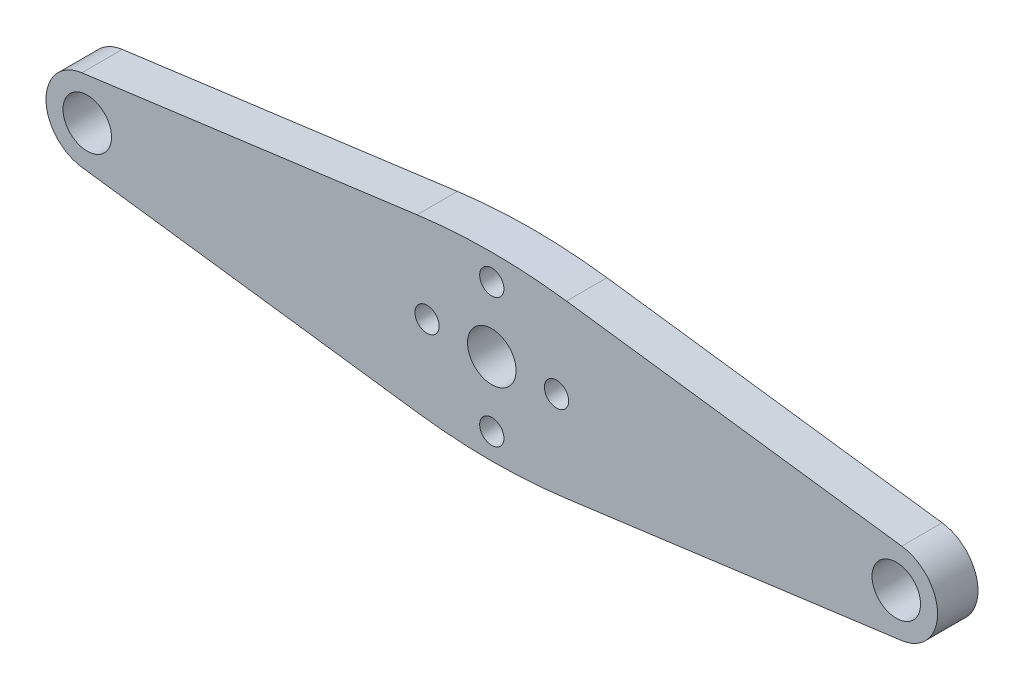
ISO-10303-21;
HEADER;
FILE_DESCRIPTION(('STEP AP214'),'2;1');
FILE_NAME('part.step','',(''),(''),'','','');
FILE_SCHEMA(('AUTOMOTIVE_DESIGN { 1 0 10303 214 1 1 1 1 }'));
ENDSEC;
DATA;
#1=APPLICATION_CONTEXT('core data for automotive mechanical design processes');
#2=APPLICATION_PROTOCOL_DEFINITION('international standard','automotive_design',2000,#1);
#3=PRODUCT_CONTEXT('',#1,'mechanical');
#4=PRODUCT('Part','Part','',(#3));
#5=PRODUCT_RELATED_PRODUCT_CATEGORY('part','',(#4));
#6=PRODUCT_DEFINITION_FORMATION('','',#4);
#7=PRODUCT_DEFINITION_CONTEXT('part definition',#1,'design');
#8=PRODUCT_DEFINITION('design','',#6,#7);
#9=PRODUCT_DEFINITION_SHAPE('','',#8);
#10=(LENGTH_UNIT() NAMED_UNIT(*) SI_UNIT(.MILLI.,.METRE.));
#11=(NAMED_UNIT(*) PLANE_ANGLE_UNIT() SI_UNIT($,.RADIAN.));
#12=(NAMED_UNIT(*) SI_UNIT($,.STERADIAN.) SOLID_ANGLE_UNIT());
#13=UNCERTAINTY_MEASURE_WITH_UNIT(LENGTH_MEASURE(1.E-05),#10,'distance_accuracy_value','');
#14=(GEOMETRIC_REPRESENTATION_CONTEXT(3) GLOBAL_UNCERTAINTY_ASSIGNED_CONTEXT((#13)) GLOBAL_UNIT_ASSIGNED_CONTEXT((#10,
#11,#12)) REPRESENTATION_CONTEXT('',''));
#15=CARTESIAN_POINT('',(0.,0.,0.));
#16=DIRECTION('',(0.,0.,1.));
#17=DIRECTION('',(1.,0.,0.));
#18=AXIS2_PLACEMENT_3D('',#15,#16,#17);
#19=CARTESIAN_POINT('',(50.,0.,5.));
#20=DIRECTION('',(0.,0.,-1.));
#21=DIRECTION('',(-1.,0.,0.));
#22=AXIS2_PLACEMENT_3D('',#19,#20,#21);
#23=PLANE('',#22);
#24=CARTESIAN_POINT('',(50.,0.,5.));
#25=DIRECTION('',(0.,0.,1.));
#26=DIRECTION('',(-1.,0.,0.));
#27=AXIS2_PLACEMENT_3D('',#24,#25,#26);
#28=CIRCLE('',#27,5.10024633771241);
#29=CARTESIAN_POINT('',(50.6728763500851,-5.05566515137672,5.));
#30=VERTEX_POINT('',#29);
#31=CARTESIAN_POINT('',(50.6728763500851,5.05566515137672,5.));
#32=VERTEX_POINT('',#31);
#33=EDGE_CURVE('E156',#30,#32,#28,.T.);
#34=ORIENTED_EDGE('',*,*,#33,.T.);
#35=DIRECTION('',(-0.991259013117456,0.131930166805804,0.));
#36=VECTOR('',#35,1.);
#37=CARTESIAN_POINT('',(50.6728763500851,5.05566515137672,5.));
#38=LINE('',#37,#36);
#39=CARTESIAN_POINT('',(9.2351116764065,10.5707637614413,5.));
#40=VERTEX_POINT('',#39);
#41=EDGE_CURVE('E104',#32,#40,#38,.T.);
#42=ORIENTED_EDGE('',*,*,#41,.T.);
#43=CARTESIAN_POINT('',(0.,-58.8173671567806,5.));
#44=DIRECTION('',(0.,0.,1.));
#45=DIRECTION('',(-1.,0.,0.));
#46=AXIS2_PLACEMENT_3D('',#43,#44,#45);
#47=CIRCLE('',#46,70.);
#48=CARTESIAN_POINT('',(-9.23511167640649,10.5707637614413,5.));
#49=VERTEX_POINT('',#48);
#50=EDGE_CURVE('E171',#40,#49,#47,.T.);
#51=ORIENTED_EDGE('',*,*,#50,.T.);
#52=DIRECTION('',(-0.991259013117456,-0.131930166805804,0.));
#53=VECTOR('',#52,1.);
#54=CARTESIAN_POINT('',(-50.6728763500851,5.05566515137672,5.));
#55=LINE('',#54,#53);
#56=CARTESIAN_POINT('',(-50.6728763500851,5.05566515137672,5.));
#57=VERTEX_POINT('',#56);
#58=EDGE_CURVE('E184',#49,#57,#55,.T.);
#59=ORIENTED_EDGE('',*,*,#58,.T.);
#60=CARTESIAN_POINT('',(-50.,0.,5.));
#61=DIRECTION('',(0.,0.,1.));
#62=DIRECTION('',(1.,0.,0.));
#63=AXIS2_PLACEMENT_3D('',#60,#61,#62);
#64=CIRCLE('',#63,5.10024633771241);
#65=CARTESIAN_POINT('',(-50.6728763500851,-5.05566515137672,5.));
#66=VERTEX_POINT('',#65);
#67=EDGE_CURVE('E123',#57,#66,#64,.T.);
#68=ORIENTED_EDGE('',*,*,#67,.T.);
#69=DIRECTION('',(0.991259013117456,-0.131930166805804,0.));
#70=VECTOR('',#69,1.);
#71=CARTESIAN_POINT('',(-50.6728763500851,-5.05566515137672,5.));
#72=LINE('',#71,#70);
#73=CARTESIAN_POINT('',(-9.23511167640653,-10.5707637614413,5.));
#74=VERTEX_POINT('',#73);
#75=EDGE_CURVE('E117',#66,#74,#72,.T.);
#76=ORIENTED_EDGE('',*,*,#75,.T.);
#77=CARTESIAN_POINT('',(0.,58.8173671567806,5.));
#78=DIRECTION('',(0.,0.,1.));
#79=DIRECTION('',(1.,0.,0.));
#80=AXIS2_PLACEMENT_3D('',#77,#78,#79);
#81=CIRCLE('',#80,70.);
#82=CARTESIAN_POINT('',(9.23511167640649,-10.5707637614413,5.));
#83=VERTEX_POINT('',#82);
#84=EDGE_CURVE('E121',#74,#83,#81,.T.);
#85=ORIENTED_EDGE('',*,*,#84,.T.);
#86=DIRECTION('',(0.991259013117456,0.131930166805804,0.));
#87=VECTOR('',#86,1.);
#88=CARTESIAN_POINT('',(50.6728763500851,-5.05566515137672,5.));
#89=LINE('',#88,#87);
#90=EDGE_CURVE('E61',#83,#30,#89,.T.);
#91=ORIENTED_EDGE('',*,*,#90,.T.);
#92=EDGE_LOOP('',(#34,#42,#51,#59,#68,#76,#85,#91));
#93=FACE_BOUND('',#92,.T.);
#94=CARTESIAN_POINT('',(0.,0.,5.));
#95=DIRECTION('',(0.,0.,1.));
#96=DIRECTION('',(1.,0.,0.));
#97=AXIS2_PLACEMENT_3D('',#94,#95,#96);
#98=CIRCLE('',#97,3.);
#99=CARTESIAN_POINT('',(3.,0.,5.));
#100=VERTEX_POINT('',#99);
#101=EDGE_CURVE('E145',#100,#100,#98,.T.);
#102=ORIENTED_EDGE('',*,*,#101,.F.);
#103=EDGE_LOOP('',(#102));
#104=FACE_BOUND('',#103,.T.);
#105=CARTESIAN_POINT('',(-8.,0.,5.));
#106=DIRECTION('',(0.,0.,1.));
#107=DIRECTION('',(1.,0.,0.));
#108=AXIS2_PLACEMENT_3D('',#105,#106,#107);
#109=CIRCLE('',#108,1.5);
#110=CARTESIAN_POINT('',(-6.5,0.,5.));
#111=VERTEX_POINT('',#110);
#112=EDGE_CURVE('E193',#111,#111,#109,.T.);
#113=ORIENTED_EDGE('',*,*,#112,.F.);
#114=EDGE_LOOP('',(#113));
#115=FACE_BOUND('',#114,.T.);
#116=CARTESIAN_POINT('',(-50.,0.,5.));
#117=DIRECTION('',(0.,0.,1.));
#118=DIRECTION('',(1.,0.,0.));
#119=AXIS2_PLACEMENT_3D('',#116,#117,#118);
#120=CIRCLE('',#119,3.);
#121=CARTESIAN_POINT('',(-47.,0.,5.));
#122=VERTEX_POINT('',#121);
#123=EDGE_CURVE('E199',#122,#122,#120,.T.);
#124=ORIENTED_EDGE('',*,*,#123,.F.);
#125=EDGE_LOOP('',(#124));
#126=FACE_BOUND('',#125,.T.);
#127=CARTESIAN_POINT('',(0.,8.,5.));
#128=DIRECTION('',(0.,0.,1.));
#129=DIRECTION('',(1.,0.,0.));
#130=AXIS2_PLACEMENT_3D('',#127,#128,#129);
#131=CIRCLE('',#130,1.5);
#132=CARTESIAN_POINT('',(1.5,8.,5.));
#133=VERTEX_POINT('',#132);
#134=EDGE_CURVE('E205',#133,#133,#131,.T.);
#135=ORIENTED_EDGE('',*,*,#134,.F.);
#136=EDGE_LOOP('',(#135));
#137=FACE_BOUND('',#136,.T.);
#138=CARTESIAN_POINT('',(8.,0.,5.));
#139=DIRECTION('',(0.,0.,1.));
#140=DIRECTION('',(1.,0.,0.));
#141=AXIS2_PLACEMENT_3D('',#138,#139,#140);
#142=CIRCLE('',#141,1.5);
#143=CARTESIAN_POINT('',(9.49999999999999,0.,5.));
#144=VERTEX_POINT('',#143);
#145=EDGE_CURVE('E211',#144,#144,#142,.T.);
#146=ORIENTED_EDGE('',*,*,#145,.F.);
#147=EDGE_LOOP('',(#146));
#148=FACE_BOUND('',#147,.T.);
#149=CARTESIAN_POINT('',(0.,-8.,5.));
#150=DIRECTION('',(0.,0.,1.));
#151=DIRECTION('',(1.,0.,0.));
#152=AXIS2_PLACEMENT_3D('',#149,#150,#151);
#153=CIRCLE('',#152,1.5);
#154=CARTESIAN_POINT('',(1.5,-8.,5.));
#155=VERTEX_POINT('',#154);
#156=EDGE_CURVE('E217',#155,#155,#153,.T.);
#157=ORIENTED_EDGE('',*,*,#156,.F.);
#158=EDGE_LOOP('',(#157));
#159=FACE_BOUND('',#158,.T.);
#160=CARTESIAN_POINT('',(50.,0.,5.));
#161=DIRECTION('',(0.,0.,1.));
#162=DIRECTION('',(-1.,0.,0.));
#163=AXIS2_PLACEMENT_3D('',#160,#161,#162);
#164=CIRCLE('',#163,3.);
#165=CARTESIAN_POINT('',(47.,0.,5.));
#166=VERTEX_POINT('',#165);
#167=EDGE_CURVE('E223',#166,#166,#164,.T.);
#168=ORIENTED_EDGE('',*,*,#167,.F.);
#169=EDGE_LOOP('',(#168));
#170=FACE_BOUND('',#169,.T.);
#171=ADVANCED_FACE('F44',(#93,#104,#115,#126,#137,#148,#159,#170),#23,.F.);
#172=CARTESIAN_POINT('',(50.,0.,0.));
#173=DIRECTION('',(0.,0.,-1.));
#174=DIRECTION('',(-1.,0.,0.));
#175=AXIS2_PLACEMENT_3D('',#172,#173,#174);
#176=PLANE('',#175);
#177=CARTESIAN_POINT('',(0.,-8.,0.));
#178=DIRECTION('',(0.,0.,1.));
#179=DIRECTION('',(1.,0.,0.));
#180=AXIS2_PLACEMENT_3D('',#177,#178,#179);
#181=CIRCLE('',#180,1.5);
#182=CARTESIAN_POINT('',(1.5,-8.,0.));
#183=VERTEX_POINT('',#182);
#184=EDGE_CURVE('E220',#183,#183,#181,.T.);
#185=ORIENTED_EDGE('',*,*,#184,.T.);
#186=EDGE_LOOP('',(#185));
#187=FACE_BOUND('',#186,.T.);
#188=CARTESIAN_POINT('',(0.,8.,0.));
#189=DIRECTION('',(0.,0.,1.));
#190=DIRECTION('',(1.,0.,0.));
#191=AXIS2_PLACEMENT_3D('',#188,#189,#190);
#192=CIRCLE('',#191,1.5);
#193=CARTESIAN_POINT('',(1.5,8.,0.));
#194=VERTEX_POINT('',#193);
#195=EDGE_CURVE('E208',#194,#194,#192,.T.);
#196=ORIENTED_EDGE('',*,*,#195,.T.);
#197=EDGE_LOOP('',(#196));
#198=FACE_BOUND('',#197,.T.);
#199=CARTESIAN_POINT('',(-8.,0.,0.));
#200=DIRECTION('',(0.,0.,1.));
#201=DIRECTION('',(1.,0.,0.));
#202=AXIS2_PLACEMENT_3D('',#199,#200,#201);
#203=CIRCLE('',#202,1.5);
#204=CARTESIAN_POINT('',(-6.5,0.,0.));
#205=VERTEX_POINT('',#204);
#206=EDGE_CURVE('E196',#205,#205,#203,.T.);
#207=ORIENTED_EDGE('',*,*,#206,.T.);
#208=EDGE_LOOP('',(#207));
#209=FACE_BOUND('',#208,.T.);
#210=CARTESIAN_POINT('',(50.,0.,0.));
#211=DIRECTION('',(0.,0.,1.));
#212=DIRECTION('',(-1.,0.,0.));
#213=AXIS2_PLACEMENT_3D('',#210,#211,#212);
#214=CIRCLE('',#213,5.10024633771241);
#215=CARTESIAN_POINT('',(50.6728763500851,-5.05566515137672,0.));
#216=VERTEX_POINT('',#215);
#217=CARTESIAN_POINT('',(50.6728763500851,5.05566515137672,0.));
#218=VERTEX_POINT('',#217);
#219=EDGE_CURVE('E141',#216,#218,#214,.T.);
#220=ORIENTED_EDGE('',*,*,#219,.F.);
#221=DIRECTION('',(0.991259013117456,0.131930166805804,0.));
#222=VECTOR('',#221,1.);
#223=CARTESIAN_POINT('',(50.6728763500851,-5.05566515137672,0.));
#224=LINE('',#223,#222);
#225=CARTESIAN_POINT('',(9.23511167640649,-10.5707637614413,0.));
#226=VERTEX_POINT('',#225);
#227=EDGE_CURVE('E96',#226,#216,#224,.T.);
#228=ORIENTED_EDGE('',*,*,#227,.F.);
#229=CARTESIAN_POINT('',(0.,58.8173671567806,0.));
#230=DIRECTION('',(0.,0.,1.));
#231=DIRECTION('',(1.,0.,0.));
#232=AXIS2_PLACEMENT_3D('',#229,#230,#231);
#233=CIRCLE('',#232,70.);
#234=CARTESIAN_POINT('',(-9.23511167640653,-10.5707637614413,0.));
#235=VERTEX_POINT('',#234);
#236=EDGE_CURVE('E90',#235,#226,#233,.T.);
#237=ORIENTED_EDGE('',*,*,#236,.F.);
#238=DIRECTION('',(0.991259013117456,-0.131930166805804,0.));
#239=VECTOR('',#238,1.);
#240=CARTESIAN_POINT('',(-50.6728763500851,-5.05566515137672,0.));
#241=LINE('',#240,#239);
#242=CARTESIAN_POINT('',(-50.6728763500851,-5.05566515137672,0.));
#243=VERTEX_POINT('',#242);
#244=EDGE_CURVE('E131',#243,#235,#241,.T.);
#245=ORIENTED_EDGE('',*,*,#244,.F.);
#246=CARTESIAN_POINT('',(-50.,0.,0.));
#247=DIRECTION('',(0.,0.,1.));
#248=DIRECTION('',(1.,0.,0.));
#249=AXIS2_PLACEMENT_3D('',#246,#247,#248);
#250=CIRCLE('',#249,5.10024633771241);
#251=CARTESIAN_POINT('',(-50.6728763500851,5.05566515137672,0.));
#252=VERTEX_POINT('',#251);
#253=EDGE_CURVE('E151',#252,#243,#250,.T.);
#254=ORIENTED_EDGE('',*,*,#253,.F.);
#255=DIRECTION('',(-0.991259013117456,-0.131930166805804,0.));
#256=VECTOR('',#255,1.);
#257=CARTESIAN_POINT('',(-50.6728763500851,5.05566515137672,0.));
#258=LINE('',#257,#256);
#259=CARTESIAN_POINT('',(-9.23511167640649,10.5707637614413,0.));
#260=VERTEX_POINT('',#259);
#261=EDGE_CURVE('E149',#260,#252,#258,.T.);
#262=ORIENTED_EDGE('',*,*,#261,.F.);
#263=CARTESIAN_POINT('',(0.,-58.8173671567806,0.));
#264=DIRECTION('',(0.,0.,1.));
#265=DIRECTION('',(-1.,0.,0.));
#266=AXIS2_PLACEMENT_3D('',#263,#264,#265);
#267=CIRCLE('',#266,70.);
#268=CARTESIAN_POINT('',(9.2351116764065,10.5707637614413,0.));
#269=VERTEX_POINT('',#268);
#270=EDGE_CURVE('E147',#269,#260,#267,.T.);
#271=ORIENTED_EDGE('',*,*,#270,.F.);
#272=DIRECTION('',(-0.991259013117456,0.131930166805804,0.));
#273=VECTOR('',#272,1.);
#274=CARTESIAN_POINT('',(50.6728763500851,5.05566515137672,0.));
#275=LINE('',#274,#273);
#276=EDGE_CURVE('E144',#218,#269,#275,.T.);
#277=ORIENTED_EDGE('',*,*,#276,.F.);
#278=EDGE_LOOP('',(#220,#228,#237,#245,#254,#262,#271,#277));
#279=FACE_BOUND('',#278,.T.);
#280=CARTESIAN_POINT('',(0.,0.,0.));
#281=DIRECTION('',(0.,0.,1.));
#282=DIRECTION('',(1.,0.,0.));
#283=AXIS2_PLACEMENT_3D('',#280,#281,#282);
#284=CIRCLE('',#283,3.);
#285=CARTESIAN_POINT('',(3.,0.,0.));
#286=VERTEX_POINT('',#285);
#287=EDGE_CURVE('E190',#286,#286,#284,.T.);
#288=ORIENTED_EDGE('',*,*,#287,.T.);
#289=EDGE_LOOP('',(#288));
#290=FACE_BOUND('',#289,.T.);
#291=CARTESIAN_POINT('',(-50.,0.,0.));
#292=DIRECTION('',(0.,0.,1.));
#293=DIRECTION('',(1.,0.,0.));
#294=AXIS2_PLACEMENT_3D('',#291,#292,#293);
#295=CIRCLE('',#294,3.);
#296=CARTESIAN_POINT('',(-47.,0.,0.));
#297=VERTEX_POINT('',#296);
#298=EDGE_CURVE('E202',#297,#297,#295,.T.);
#299=ORIENTED_EDGE('',*,*,#298,.T.);
#300=EDGE_LOOP('',(#299));
#301=FACE_BOUND('',#300,.T.);
#302=CARTESIAN_POINT('',(8.,0.,0.));
#303=DIRECTION('',(0.,0.,1.));
#304=DIRECTION('',(1.,0.,0.));
#305=AXIS2_PLACEMENT_3D('',#302,#303,#304);
#306=CIRCLE('',#305,1.5);
#307=CARTESIAN_POINT('',(9.49999999999999,0.,0.));
#308=VERTEX_POINT('',#307);
#309=EDGE_CURVE('E214',#308,#308,#306,.T.);
#310=ORIENTED_EDGE('',*,*,#309,.T.);
#311=EDGE_LOOP('',(#310));
#312=FACE_BOUND('',#311,.T.);
#313=CARTESIAN_POINT('',(50.,0.,0.));
#314=DIRECTION('',(0.,0.,1.));
#315=DIRECTION('',(-1.,0.,0.));
#316=AXIS2_PLACEMENT_3D('',#313,#314,#315);
#317=CIRCLE('',#316,3.);
#318=CARTESIAN_POINT('',(47.,0.,0.));
#319=VERTEX_POINT('',#318);
#320=EDGE_CURVE('E226',#319,#319,#317,.T.);
#321=ORIENTED_EDGE('',*,*,#320,.T.);
#322=EDGE_LOOP('',(#321));
#323=FACE_BOUND('',#322,.T.);
#324=ADVANCED_FACE('F175',(#187,#198,#209,#279,#290,#301,#312,#323),#176,.T.);
#325=CARTESIAN_POINT('',(50.,0.,5.));
#326=DIRECTION('',(0.,0.,-1.));
#327=DIRECTION('',(-1.,0.,0.));
#328=AXIS2_PLACEMENT_3D('',#325,#326,#327);
#329=CYLINDRICAL_SURFACE('',#328,5.10024633771241);
#330=ORIENTED_EDGE('',*,*,#219,.T.);
#331=DIRECTION('',(0.,0.,-1.));
#332=VECTOR('',#331,1.);
#333=CARTESIAN_POINT('',(50.6728763500851,5.05566515137672,5.));
#334=LINE('',#333,#332);
#335=EDGE_CURVE('E13',#32,#218,#334,.T.);
#336=ORIENTED_EDGE('',*,*,#335,.F.);
#337=ORIENTED_EDGE('',*,*,#33,.F.);
#338=DIRECTION('',(0.,0.,-1.));
#339=VECTOR('',#338,1.);
#340=CARTESIAN_POINT('',(50.6728763500851,-5.05566515137672,5.));
#341=LINE('',#340,#339);
#342=EDGE_CURVE('E137',#30,#216,#341,.T.);
#343=ORIENTED_EDGE('',*,*,#342,.T.);
#344=EDGE_LOOP('',(#330,#336,#337,#343));
#345=FACE_BOUND('',#344,.T.);
#346=ADVANCED_FACE('F46',(#345),#329,.T.);
#347=CARTESIAN_POINT('',(50.6728763500851,5.05566515137672,5.));
#348=DIRECTION('',(-0.131930166805804,-0.991259013117456,0.));
#349=DIRECTION('',(0.991259013117456,-0.131930166805804,0.));
#350=AXIS2_PLACEMENT_3D('',#347,#348,#349);
#351=PLANE('',#350);
#352=ORIENTED_EDGE('',*,*,#276,.T.);
#353=DIRECTION('',(0.,0.,-1.));
#354=VECTOR('',#353,1.);
#355=CARTESIAN_POINT('',(9.2351116764065,10.5707637614413,5.));
#356=LINE('',#355,#354);
#357=EDGE_CURVE('E53',#40,#269,#356,.T.);
#358=ORIENTED_EDGE('',*,*,#357,.F.);
#359=ORIENTED_EDGE('',*,*,#41,.F.);
#360=ORIENTED_EDGE('',*,*,#335,.T.);
#361=EDGE_LOOP('',(#352,#358,#359,#360));
#362=FACE_BOUND('',#361,.T.);
#363=ADVANCED_FACE('F258',(#362),#351,.F.);
#364=CARTESIAN_POINT('',(0.,-58.8173671567806,5.));
#365=DIRECTION('',(0.,0.,-1.));
#366=DIRECTION('',(-1.,0.,0.));
#367=AXIS2_PLACEMENT_3D('',#364,#365,#366);
#368=CYLINDRICAL_SURFACE('',#367,70.);
#369=ORIENTED_EDGE('',*,*,#270,.T.);
#370=DIRECTION('',(0.,0.,-1.));
#371=VECTOR('',#370,1.);
#372=CARTESIAN_POINT('',(-9.23511167640649,10.5707637614413,5.));
#373=LINE('',#372,#371);
#374=EDGE_CURVE('E163',#49,#260,#373,.T.);
#375=ORIENTED_EDGE('',*,*,#374,.F.);
#376=ORIENTED_EDGE('',*,*,#50,.F.);
#377=ORIENTED_EDGE('',*,*,#357,.T.);
#378=EDGE_LOOP('',(#369,#375,#376,#377));
#379=FACE_BOUND('',#378,.T.);
#380=ADVANCED_FACE('F169',(#379),#368,.T.);
#381=CARTESIAN_POINT('',(-50.6728763500851,5.05566515137672,5.));
#382=DIRECTION('',(0.131930166805804,-0.991259013117456,0.));
#383=DIRECTION('',(0.991259013117456,0.131930166805804,0.));
#384=AXIS2_PLACEMENT_3D('',#381,#382,#383);
#385=PLANE('',#384);
#386=ORIENTED_EDGE('',*,*,#261,.T.);
#387=DIRECTION('',(0.,0.,-1.));
#388=VECTOR('',#387,1.);
#389=CARTESIAN_POINT('',(-50.6728763500851,5.05566515137672,5.));
#390=LINE('',#389,#388);
#391=EDGE_CURVE('E160',#57,#252,#390,.T.);
#392=ORIENTED_EDGE('',*,*,#391,.F.);
#393=ORIENTED_EDGE('',*,*,#58,.F.);
#394=ORIENTED_EDGE('',*,*,#374,.T.);
#395=EDGE_LOOP('',(#386,#392,#393,#394));
#396=FACE_BOUND('',#395,.T.);
#397=ADVANCED_FACE('F180',(#396),#385,.F.);
#398=CARTESIAN_POINT('',(-50.,0.,5.));
#399=DIRECTION('',(0.,0.,-1.));
#400=DIRECTION('',(-1.,0.,0.));
#401=AXIS2_PLACEMENT_3D('',#398,#399,#400);
#402=CYLINDRICAL_SURFACE('',#401,5.10024633771241);
#403=ORIENTED_EDGE('',*,*,#253,.T.);
#404=DIRECTION('',(0.,0.,-1.));
#405=VECTOR('',#404,1.);
#406=CARTESIAN_POINT('',(-50.6728763500851,-5.05566515137672,5.));
#407=LINE('',#406,#405);
#408=EDGE_CURVE('E132',#66,#243,#407,.T.);
#409=ORIENTED_EDGE('',*,*,#408,.F.);
#410=ORIENTED_EDGE('',*,*,#67,.F.);
#411=ORIENTED_EDGE('',*,*,#391,.T.);
#412=EDGE_LOOP('',(#403,#409,#410,#411));
#413=FACE_BOUND('',#412,.T.);
#414=ADVANCED_FACE('F183',(#413),#402,.T.);
#415=CARTESIAN_POINT('',(-50.6728763500851,-5.05566515137672,5.));
#416=DIRECTION('',(0.131930166805804,0.991259013117456,0.));
#417=DIRECTION('',(-0.991259013117456,0.131930166805804,0.));
#418=AXIS2_PLACEMENT_3D('',#415,#416,#417);
#419=PLANE('',#418);
#420=ORIENTED_EDGE('',*,*,#244,.T.);
#421=DIRECTION('',(0.,0.,-1.));
#422=VECTOR('',#421,1.);
#423=CARTESIAN_POINT('',(-9.23511167640653,-10.5707637614413,5.));
#424=LINE('',#423,#422);
#425=EDGE_CURVE('E128',#74,#235,#424,.T.);
#426=ORIENTED_EDGE('',*,*,#425,.F.);
#427=ORIENTED_EDGE('',*,*,#75,.F.);
#428=ORIENTED_EDGE('',*,*,#408,.T.);
#429=EDGE_LOOP('',(#420,#426,#427,#428));
#430=FACE_BOUND('',#429,.T.);
#431=ADVANCED_FACE('F129',(#430),#419,.F.);
#432=CARTESIAN_POINT('',(0.,58.8173671567806,5.));
#433=DIRECTION('',(0.,0.,-1.));
#434=DIRECTION('',(-1.,0.,0.));
#435=AXIS2_PLACEMENT_3D('',#432,#433,#434);
#436=CYLINDRICAL_SURFACE('',#435,70.);
#437=ORIENTED_EDGE('',*,*,#236,.T.);
#438=DIRECTION('',(0.,0.,-1.));
#439=VECTOR('',#438,1.);
#440=CARTESIAN_POINT('',(9.23511167640649,-10.5707637614413,5.));
#441=LINE('',#440,#439);
#442=EDGE_CURVE('E133',#83,#226,#441,.T.);
#443=ORIENTED_EDGE('',*,*,#442,.F.);
#444=ORIENTED_EDGE('',*,*,#84,.F.);
#445=ORIENTED_EDGE('',*,*,#425,.T.);
#446=EDGE_LOOP('',(#437,#443,#444,#445));
#447=FACE_BOUND('',#446,.T.);
#448=ADVANCED_FACE('F135',(#447),#436,.T.);
#449=CARTESIAN_POINT('',(50.6728763500851,-5.05566515137672,5.));
#450=DIRECTION('',(-0.131930166805804,0.991259013117456,0.));
#451=DIRECTION('',(-0.991259013117456,-0.131930166805804,0.));
#452=AXIS2_PLACEMENT_3D('',#449,#450,#451);
#453=PLANE('',#452);
#454=ORIENTED_EDGE('',*,*,#227,.T.);
#455=ORIENTED_EDGE('',*,*,#342,.F.);
#456=ORIENTED_EDGE('',*,*,#90,.F.);
#457=ORIENTED_EDGE('',*,*,#442,.T.);
#458=EDGE_LOOP('',(#454,#455,#456,#457));
#459=FACE_BOUND('',#458,.T.);
#460=ADVANCED_FACE('F246',(#459),#453,.F.);
#461=CARTESIAN_POINT('',(0.,0.,5.));
#462=DIRECTION('',(0.,0.,-1.));
#463=DIRECTION('',(-1.,0.,0.));
#464=AXIS2_PLACEMENT_3D('',#461,#462,#463);
#465=CYLINDRICAL_SURFACE('',#464,3.);
#466=ORIENTED_EDGE('',*,*,#101,.T.);
#467=EDGE_LOOP('',(#466));
#468=FACE_BOUND('',#467,.T.);
#469=ORIENTED_EDGE('',*,*,#287,.F.);
#470=EDGE_LOOP('',(#469));
#471=FACE_BOUND('',#470,.T.);
#472=ADVANCED_FACE('F243',(#468,#471),#465,.F.);
#473=CARTESIAN_POINT('',(-8.,0.,5.));
#474=DIRECTION('',(0.,0.,-1.));
#475=DIRECTION('',(-1.,0.,0.));
#476=AXIS2_PLACEMENT_3D('',#473,#474,#475);
#477=CYLINDRICAL_SURFACE('',#476,1.5);
#478=ORIENTED_EDGE('',*,*,#112,.T.);
#479=EDGE_LOOP('',(#478));
#480=FACE_BOUND('',#479,.T.);
#481=ORIENTED_EDGE('',*,*,#206,.F.);
#482=EDGE_LOOP('',(#481));
#483=FACE_BOUND('',#482,.T.);
#484=ADVANCED_FACE('F322',(#480,#483),#477,.F.);
#485=CARTESIAN_POINT('',(-50.,0.,5.));
#486=DIRECTION('',(0.,0.,-1.));
#487=DIRECTION('',(-1.,0.,0.));
#488=AXIS2_PLACEMENT_3D('',#485,#486,#487);
#489=CYLINDRICAL_SURFACE('',#488,3.);
#490=ORIENTED_EDGE('',*,*,#123,.T.);
#491=EDGE_LOOP('',(#490));
#492=FACE_BOUND('',#491,.T.);
#493=ORIENTED_EDGE('',*,*,#298,.F.);
#494=EDGE_LOOP('',(#493));
#495=FACE_BOUND('',#494,.T.);
#496=ADVANCED_FACE('F330',(#492,#495),#489,.F.);
#497=CARTESIAN_POINT('',(0.,8.,5.));
#498=DIRECTION('',(0.,0.,-1.));
#499=DIRECTION('',(-1.,0.,0.));
#500=AXIS2_PLACEMENT_3D('',#497,#498,#499);
#501=CYLINDRICAL_SURFACE('',#500,1.5);
#502=ORIENTED_EDGE('',*,*,#134,.T.);
#503=EDGE_LOOP('',(#502));
#504=FACE_BOUND('',#503,.T.);
#505=ORIENTED_EDGE('',*,*,#195,.F.);
#506=EDGE_LOOP('',(#505));
#507=FACE_BOUND('',#506,.T.);
#508=ADVANCED_FACE('F338',(#504,#507),#501,.F.);
#509=CARTESIAN_POINT('',(8.,0.,5.));
#510=DIRECTION('',(0.,0.,-1.));
#511=DIRECTION('',(-1.,0.,0.));
#512=AXIS2_PLACEMENT_3D('',#509,#510,#511);
#513=CYLINDRICAL_SURFACE('',#512,1.5);
#514=ORIENTED_EDGE('',*,*,#145,.T.);
#515=EDGE_LOOP('',(#514));
#516=FACE_BOUND('',#515,.T.);
#517=ORIENTED_EDGE('',*,*,#309,.F.);
#518=EDGE_LOOP('',(#517));
#519=FACE_BOUND('',#518,.T.);
#520=ADVANCED_FACE('F347',(#516,#519),#513,.F.);
#521=CARTESIAN_POINT('',(0.,-8.,5.));
#522=DIRECTION('',(0.,0.,-1.));
#523=DIRECTION('',(-1.,0.,0.));
#524=AXIS2_PLACEMENT_3D('',#521,#522,#523);
#525=CYLINDRICAL_SURFACE('',#524,1.5);
#526=ORIENTED_EDGE('',*,*,#156,.T.);
#527=EDGE_LOOP('',(#526));
#528=FACE_BOUND('',#527,.T.);
#529=ORIENTED_EDGE('',*,*,#184,.F.);
#530=EDGE_LOOP('',(#529));
#531=FACE_BOUND('',#530,.T.);
#532=ADVANCED_FACE('F356',(#528,#531),#525,.F.);
#533=CARTESIAN_POINT('',(50.,0.,5.));
#534=DIRECTION('',(0.,0.,-1.));
#535=DIRECTION('',(-1.,0.,0.));
#536=AXIS2_PLACEMENT_3D('',#533,#534,#535);
#537=CYLINDRICAL_SURFACE('',#536,3.);
#538=ORIENTED_EDGE('',*,*,#167,.T.);
#539=EDGE_LOOP('',(#538));
#540=FACE_BOUND('',#539,.T.);
#541=ORIENTED_EDGE('',*,*,#320,.F.);
#542=EDGE_LOOP('',(#541));
#543=FACE_BOUND('',#542,.T.);
#544=ADVANCED_FACE('F232',(#540,#543),#537,.F.);
#545=CLOSED_SHELL('',(#171,#324,#346,#363,#380,#397,#414,#431,#448,#460,#472,#484,#496,#508,
#520,#532,#544));
#546=MANIFOLD_SOLID_BREP('B2',#545);
#547=ADVANCED_BREP_SHAPE_REPRESENTATION('',(#18,#546),#14);
#548=SHAPE_DEFINITION_REPRESENTATION(#9,#547);
ENDSEC;
END-ISO-10303-21;
